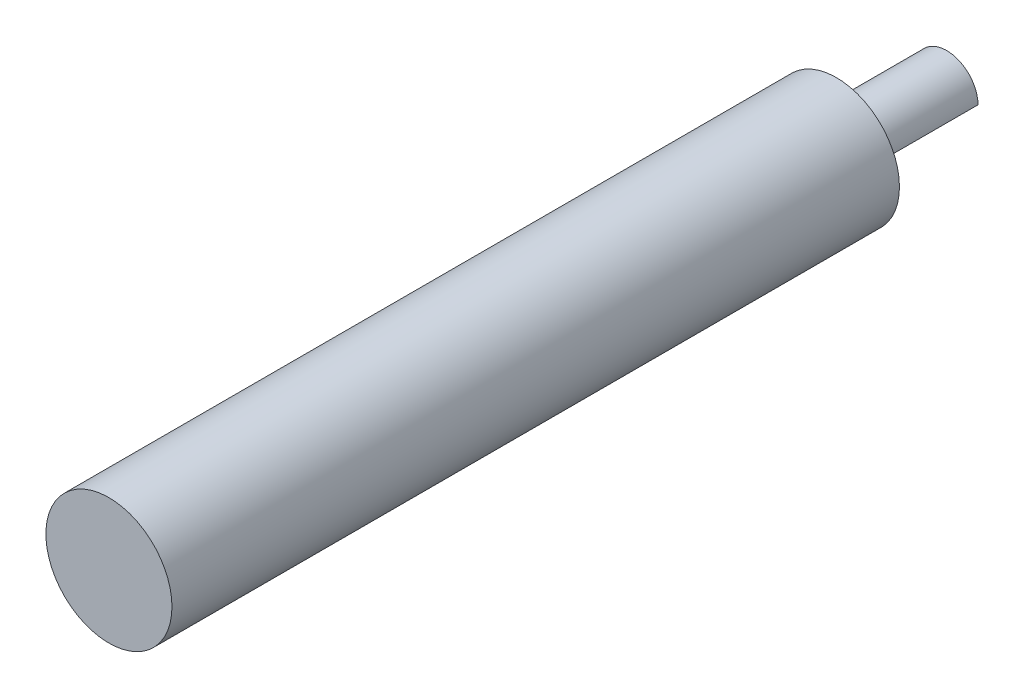
ISO-10303-21;
HEADER;
FILE_DESCRIPTION(('STEP AP214'),'2;1');
FILE_NAME('part.step','',(''),(''),'','','');
FILE_SCHEMA(('AUTOMOTIVE_DESIGN { 1 0 10303 214 1 1 1 1 }'));
ENDSEC;
DATA;
#1=APPLICATION_CONTEXT('core data for automotive mechanical design processes');
#2=APPLICATION_PROTOCOL_DEFINITION('international standard','automotive_design',2000,#1);
#3=PRODUCT_CONTEXT('',#1,'mechanical');
#4=PRODUCT('Part','Part','',(#3));
#5=PRODUCT_RELATED_PRODUCT_CATEGORY('part','',(#4));
#6=PRODUCT_DEFINITION_FORMATION('','',#4);
#7=PRODUCT_DEFINITION_CONTEXT('part definition',#1,'design');
#8=PRODUCT_DEFINITION('design','',#6,#7);
#9=PRODUCT_DEFINITION_SHAPE('','',#8);
#10=(LENGTH_UNIT() NAMED_UNIT(*) SI_UNIT(.MILLI.,.METRE.));
#11=(NAMED_UNIT(*) PLANE_ANGLE_UNIT() SI_UNIT($,.RADIAN.));
#12=(NAMED_UNIT(*) SI_UNIT($,.STERADIAN.) SOLID_ANGLE_UNIT());
#13=UNCERTAINTY_MEASURE_WITH_UNIT(LENGTH_MEASURE(1.E-05),#10,'distance_accuracy_value','');
#14=(GEOMETRIC_REPRESENTATION_CONTEXT(3) GLOBAL_UNCERTAINTY_ASSIGNED_CONTEXT((#13)) GLOBAL_UNIT_ASSIGNED_CONTEXT((#10,
#11,#12)) REPRESENTATION_CONTEXT('',''));
#15=CARTESIAN_POINT('',(0.,0.,0.));
#16=DIRECTION('',(0.,0.,1.));
#17=DIRECTION('',(1.,0.,0.));
#18=AXIS2_PLACEMENT_3D('',#15,#16,#17);
#19=CARTESIAN_POINT('',(0.,0.,11.0998));
#20=DIRECTION('',(0.,0.,-1.));
#21=DIRECTION('',(-1.,0.,0.));
#22=AXIS2_PLACEMENT_3D('',#19,#20,#21);
#23=CYLINDRICAL_SURFACE('',#22,3.1623);
#24=DIRECTION('',(0.,0.,1.));
#25=VECTOR('',#24,1.);
#26=CARTESIAN_POINT('',(-0.00124959849113495,-3.16229975310748,-31.6935730163358));
#27=LINE('',#26,#25);
#28=CARTESIAN_POINT('',(-0.00124959849113538,-3.16229975310748,0.));
#29=VERTEX_POINT('',#28);
#30=CARTESIAN_POINT('',(-0.00124959849113538,-3.16229975310748,11.0998));
#31=VERTEX_POINT('',#30);
#32=EDGE_CURVE('E49',#29,#31,#27,.T.);
#33=ORIENTED_EDGE('',*,*,#32,.T.);
#34=CARTESIAN_POINT('',(0.,0.,11.0998));
#35=DIRECTION('',(0.,0.,1.));
#36=DIRECTION('',(1.,0.,0.));
#37=AXIS2_PLACEMENT_3D('',#34,#35,#36);
#38=CIRCLE('',#37,3.1623);
#39=CARTESIAN_POINT('',(3.16229975310748,0.00124959849113582,11.0998));
#40=VERTEX_POINT('',#39);
#41=EDGE_CURVE('E42',#40,#31,#38,.T.);
#42=ORIENTED_EDGE('',*,*,#41,.F.);
#43=DIRECTION('',(0.,0.,1.));
#44=VECTOR('',#43,1.);
#45=CARTESIAN_POINT('',(3.16229975310748,0.0012495984911356,-31.6935730163358));
#46=LINE('',#45,#44);
#47=CARTESIAN_POINT('',(3.16229975310748,0.0012495984911356,0.));
#48=VERTEX_POINT('',#47);
#49=EDGE_CURVE('E61',#48,#40,#46,.T.);
#50=ORIENTED_EDGE('',*,*,#49,.F.);
#51=CARTESIAN_POINT('',(0.,0.,0.));
#52=DIRECTION('',(0.,0.,1.));
#53=DIRECTION('',(1.,0.,0.));
#54=AXIS2_PLACEMENT_3D('',#51,#52,#53);
#55=CIRCLE('',#54,3.1623);
#56=EDGE_CURVE('E68',#48,#29,#55,.T.);
#57=ORIENTED_EDGE('',*,*,#56,.T.);
#58=EDGE_LOOP('',(#33,#42,#50,#57));
#59=FACE_BOUND('',#58,.T.);
#60=ADVANCED_FACE('F35',(#59),#23,.T.);
#61=CARTESIAN_POINT('',(0.,0.,0.));
#62=DIRECTION('',(0.,0.,1.));
#63=DIRECTION('',(1.,0.,0.));
#64=AXIS2_PLACEMENT_3D('',#61,#62,#63);
#65=PLANE('',#64);
#66=DIRECTION('',(0.707106781186547,0.707106781186548,0.));
#67=VECTOR('',#66,1.);
#68=CARTESIAN_POINT('',(1.58052507730817,-1.58052507730817,0.));
#69=LINE('',#68,#67);
#70=EDGE_CURVE('E11',#29,#48,#69,.T.);
#71=ORIENTED_EDGE('',*,*,#70,.F.);
#72=ORIENTED_EDGE('',*,*,#56,.F.);
#73=EDGE_LOOP('',(#71,#72));
#74=FACE_BOUND('',#73,.T.);
#75=ADVANCED_FACE('F94',(#74),#65,.F.);
#76=CARTESIAN_POINT('',(-0.00124959849113495,-3.16229975310748,-31.6935730163358));
#77=DIRECTION('',(0.707106781186547,-0.707106781186547,0.));
#78=DIRECTION('',(0.707106781186547,0.707106781186548,0.));
#79=AXIS2_PLACEMENT_3D('',#76,#77,#78);
#80=PLANE('',#79);
#81=DIRECTION('',(0.707106781186547,0.707106781186548,0.));
#82=VECTOR('',#81,1.);
#83=CARTESIAN_POINT('',(1.58052507730817,-1.58052507730817,11.0998));
#84=LINE('',#83,#82);
#85=EDGE_CURVE('E64',#31,#40,#84,.T.);
#86=ORIENTED_EDGE('',*,*,#85,.F.);
#87=ORIENTED_EDGE('',*,*,#32,.F.);
#88=ORIENTED_EDGE('',*,*,#70,.T.);
#89=ORIENTED_EDGE('',*,*,#49,.T.);
#90=EDGE_LOOP('',(#86,#87,#88,#89));
#91=FACE_BOUND('',#90,.T.);
#92=ADVANCED_FACE('F62',(#91),#80,.T.);
#93=CARTESIAN_POINT('',(0.,0.,11.0998));
#94=DIRECTION('',(0.,0.,1.));
#95=DIRECTION('',(1.,0.,0.));
#96=AXIS2_PLACEMENT_3D('',#93,#94,#95);
#97=PLANE('',#96);
#98=CARTESIAN_POINT('',(0.,0.,11.0998));
#99=DIRECTION('',(0.,0.,1.));
#100=DIRECTION('',(1.,0.,0.));
#101=AXIS2_PLACEMENT_3D('',#98,#99,#100);
#102=CIRCLE('',#101,6.35);
#103=CARTESIAN_POINT('',(6.35,0.,11.0998));
#104=VERTEX_POINT('',#103);
#105=EDGE_CURVE('E75',#104,#104,#102,.T.);
#106=ORIENTED_EDGE('',*,*,#105,.F.);
#107=EDGE_LOOP('',(#106));
#108=FACE_BOUND('',#107,.T.);
#109=ORIENTED_EDGE('',*,*,#85,.T.);
#110=ORIENTED_EDGE('',*,*,#41,.T.);
#111=EDGE_LOOP('',(#109,#110));
#112=FACE_BOUND('',#111,.T.);
#113=ADVANCED_FACE('F70',(#108,#112),#97,.F.);
#114=CARTESIAN_POINT('',(0.,0.,84.3788));
#115=DIRECTION('',(0.,0.,-1.));
#116=DIRECTION('',(-1.,0.,0.));
#117=AXIS2_PLACEMENT_3D('',#114,#115,#116);
#118=CYLINDRICAL_SURFACE('',#117,6.35);
#119=CARTESIAN_POINT('',(0.,0.,84.3788));
#120=DIRECTION('',(0.,0.,1.));
#121=DIRECTION('',(1.,0.,0.));
#122=AXIS2_PLACEMENT_3D('',#119,#120,#121);
#123=CIRCLE('',#122,6.35);
#124=CARTESIAN_POINT('',(6.35,0.,84.3788));
#125=VERTEX_POINT('',#124);
#126=EDGE_CURVE('E73',#125,#125,#123,.T.);
#127=ORIENTED_EDGE('',*,*,#126,.F.);
#128=EDGE_LOOP('',(#127));
#129=FACE_BOUND('',#128,.T.);
#130=ORIENTED_EDGE('',*,*,#105,.T.);
#131=EDGE_LOOP('',(#130));
#132=FACE_BOUND('',#131,.T.);
#133=ADVANCED_FACE('F83',(#129,#132),#118,.T.);
#134=CARTESIAN_POINT('',(0.,0.,84.3788));
#135=DIRECTION('',(0.,0.,1.));
#136=DIRECTION('',(1.,0.,0.));
#137=AXIS2_PLACEMENT_3D('',#134,#135,#136);
#138=PLANE('',#137);
#139=ORIENTED_EDGE('',*,*,#126,.T.);
#140=EDGE_LOOP('',(#139));
#141=FACE_BOUND('',#140,.T.);
#142=ADVANCED_FACE('F81',(#141),#138,.T.);
#143=CLOSED_SHELL('',(#60,#75,#92,#113,#133,#142));
#144=MANIFOLD_SOLID_BREP('B2',#143);
#145=ADVANCED_BREP_SHAPE_REPRESENTATION('',(#18,#144),#14);
#146=SHAPE_DEFINITION_REPRESENTATION(#9,#145);
ENDSEC;
END-ISO-10303-21;
